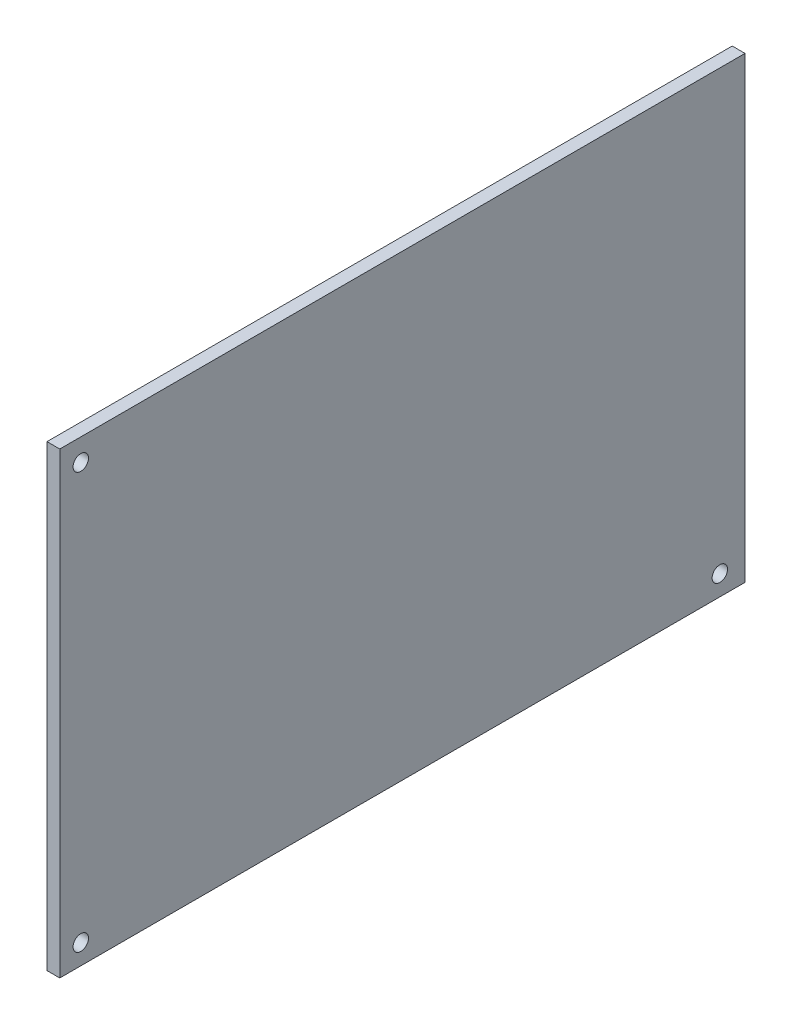
ISO-10303-21;
HEADER;
FILE_DESCRIPTION(('STEP AP214'),'2;1');
FILE_NAME('part.step','',(''),(''),'','','');
FILE_SCHEMA(('AUTOMOTIVE_DESIGN { 1 0 10303 214 1 1 1 1 }'));
ENDSEC;
DATA;
#1=APPLICATION_CONTEXT('core data for automotive mechanical design processes');
#2=APPLICATION_PROTOCOL_DEFINITION('international standard','automotive_design',2000,#1);
#3=PRODUCT_CONTEXT('',#1,'mechanical');
#4=PRODUCT('Part','Part','',(#3));
#5=PRODUCT_RELATED_PRODUCT_CATEGORY('part','',(#4));
#6=PRODUCT_DEFINITION_FORMATION('','',#4);
#7=PRODUCT_DEFINITION_CONTEXT('part definition',#1,'design');
#8=PRODUCT_DEFINITION('design','',#6,#7);
#9=PRODUCT_DEFINITION_SHAPE('','',#8);
#10=(LENGTH_UNIT() NAMED_UNIT(*) SI_UNIT(.MILLI.,.METRE.));
#11=(NAMED_UNIT(*) PLANE_ANGLE_UNIT() SI_UNIT($,.RADIAN.));
#12=(NAMED_UNIT(*) SI_UNIT($,.STERADIAN.) SOLID_ANGLE_UNIT());
#13=UNCERTAINTY_MEASURE_WITH_UNIT(LENGTH_MEASURE(1.E-05),#10,'distance_accuracy_value','');
#14=(GEOMETRIC_REPRESENTATION_CONTEXT(3) GLOBAL_UNCERTAINTY_ASSIGNED_CONTEXT((#13)) GLOBAL_UNIT_ASSIGNED_CONTEXT((#10,
#11,#12)) REPRESENTATION_CONTEXT('',''));
#15=CARTESIAN_POINT('',(0.,0.,0.));
#16=DIRECTION('',(0.,0.,1.));
#17=DIRECTION('',(1.,0.,0.));
#18=AXIS2_PLACEMENT_3D('',#15,#16,#17);
#19=CARTESIAN_POINT('',(1.66,0.,0.));
#20=DIRECTION('',(0.,0.,-1.));
#21=DIRECTION('',(0.,1.,0.));
#22=AXIS2_PLACEMENT_3D('',#19,#20,#21);
#23=PLANE('',#22);
#24=DIRECTION('',(0.,-1.,0.));
#25=VECTOR('',#24,1.);
#26=CARTESIAN_POINT('',(0.,0.,0.));
#27=LINE('',#26,#25);
#28=CARTESIAN_POINT('',(0.,59.5,0.));
#29=VERTEX_POINT('',#28);
#30=CARTESIAN_POINT('',(0.,0.,0.));
#31=VERTEX_POINT('',#30);
#32=EDGE_CURVE('E97',#29,#31,#27,.T.);
#33=ORIENTED_EDGE('',*,*,#32,.T.);
#34=DIRECTION('',(-1.,0.,0.));
#35=VECTOR('',#34,1.);
#36=CARTESIAN_POINT('',(1.66,0.,0.));
#37=LINE('',#36,#35);
#38=CARTESIAN_POINT('',(1.66,0.,0.));
#39=VERTEX_POINT('',#38);
#40=EDGE_CURVE('E11',#39,#31,#37,.T.);
#41=ORIENTED_EDGE('',*,*,#40,.F.);
#42=DIRECTION('',(0.,-1.,0.));
#43=VECTOR('',#42,1.);
#44=CARTESIAN_POINT('',(1.66,0.,0.));
#45=LINE('',#44,#43);
#46=CARTESIAN_POINT('',(1.66,59.5,0.));
#47=VERTEX_POINT('',#46);
#48=EDGE_CURVE('E85',#47,#39,#45,.T.);
#49=ORIENTED_EDGE('',*,*,#48,.F.);
#50=DIRECTION('',(-1.,0.,0.));
#51=VECTOR('',#50,1.);
#52=CARTESIAN_POINT('',(1.66,59.5,0.));
#53=LINE('',#52,#51);
#54=EDGE_CURVE('E93',#47,#29,#53,.T.);
#55=ORIENTED_EDGE('',*,*,#54,.T.);
#56=EDGE_LOOP('',(#33,#41,#49,#55));
#57=FACE_BOUND('',#56,.T.);
#58=ADVANCED_FACE('F34',(#57),#23,.F.);
#59=CARTESIAN_POINT('',(1.66,0.,0.));
#60=DIRECTION('',(0.,1.,0.));
#61=DIRECTION('',(0.,0.,1.));
#62=AXIS2_PLACEMENT_3D('',#59,#60,#61);
#63=PLANE('',#62);
#64=DIRECTION('',(0.,0.,-1.));
#65=VECTOR('',#64,1.);
#66=CARTESIAN_POINT('',(0.,0.,0.));
#67=LINE('',#66,#65);
#68=CARTESIAN_POINT('',(0.,0.,-89.));
#69=VERTEX_POINT('',#68);
#70=EDGE_CURVE('E89',#31,#69,#67,.T.);
#71=ORIENTED_EDGE('',*,*,#70,.T.);
#72=DIRECTION('',(-1.,0.,0.));
#73=VECTOR('',#72,1.);
#74=CARTESIAN_POINT('',(1.66,0.,-89.));
#75=LINE('',#74,#73);
#76=CARTESIAN_POINT('',(1.66,0.,-89.));
#77=VERTEX_POINT('',#76);
#78=EDGE_CURVE('E42',#77,#69,#75,.T.);
#79=ORIENTED_EDGE('',*,*,#78,.F.);
#80=DIRECTION('',(0.,0.,-1.));
#81=VECTOR('',#80,1.);
#82=CARTESIAN_POINT('',(1.66,0.,0.));
#83=LINE('',#82,#81);
#84=EDGE_CURVE('E80',#39,#77,#83,.T.);
#85=ORIENTED_EDGE('',*,*,#84,.F.);
#86=ORIENTED_EDGE('',*,*,#40,.T.);
#87=EDGE_LOOP('',(#71,#79,#85,#86));
#88=FACE_BOUND('',#87,.T.);
#89=ADVANCED_FACE('F88',(#88),#63,.F.);
#90=CARTESIAN_POINT('',(1.66,0.,-89.));
#91=DIRECTION('',(0.,0.,1.));
#92=DIRECTION('',(0.,-1.,0.));
#93=AXIS2_PLACEMENT_3D('',#90,#91,#92);
#94=PLANE('',#93);
#95=DIRECTION('',(0.,1.,0.));
#96=VECTOR('',#95,1.);
#97=CARTESIAN_POINT('',(0.,0.,-89.));
#98=LINE('',#97,#96);
#99=CARTESIAN_POINT('',(0.,59.5,-89.));
#100=VERTEX_POINT('',#99);
#101=EDGE_CURVE('E67',#69,#100,#98,.T.);
#102=ORIENTED_EDGE('',*,*,#101,.T.);
#103=DIRECTION('',(-1.,0.,0.));
#104=VECTOR('',#103,1.);
#105=CARTESIAN_POINT('',(1.66,59.5,-89.));
#106=LINE('',#105,#104);
#107=CARTESIAN_POINT('',(1.66,59.5,-89.));
#108=VERTEX_POINT('',#107);
#109=EDGE_CURVE('E90',#108,#100,#106,.T.);
#110=ORIENTED_EDGE('',*,*,#109,.F.);
#111=DIRECTION('',(0.,1.,0.));
#112=VECTOR('',#111,1.);
#113=CARTESIAN_POINT('',(1.66,0.,-89.));
#114=LINE('',#113,#112);
#115=EDGE_CURVE('E83',#77,#108,#114,.T.);
#116=ORIENTED_EDGE('',*,*,#115,.F.);
#117=ORIENTED_EDGE('',*,*,#78,.T.);
#118=EDGE_LOOP('',(#102,#110,#116,#117));
#119=FACE_BOUND('',#118,.T.);
#120=ADVANCED_FACE('F91',(#119),#94,.F.);
#121=CARTESIAN_POINT('',(1.66,59.5,0.));
#122=DIRECTION('',(0.,-1.,0.));
#123=DIRECTION('',(0.,0.,-1.));
#124=AXIS2_PLACEMENT_3D('',#121,#122,#123);
#125=PLANE('',#124);
#126=DIRECTION('',(0.,0.,1.));
#127=VECTOR('',#126,1.);
#128=CARTESIAN_POINT('',(0.,59.5,0.));
#129=LINE('',#128,#127);
#130=EDGE_CURVE('E73',#100,#29,#129,.T.);
#131=ORIENTED_EDGE('',*,*,#130,.T.);
#132=ORIENTED_EDGE('',*,*,#54,.F.);
#133=DIRECTION('',(0.,0.,1.));
#134=VECTOR('',#133,1.);
#135=CARTESIAN_POINT('',(1.66,59.5,0.));
#136=LINE('',#135,#134);
#137=EDGE_CURVE('E50',#108,#47,#136,.T.);
#138=ORIENTED_EDGE('',*,*,#137,.F.);
#139=ORIENTED_EDGE('',*,*,#109,.T.);
#140=EDGE_LOOP('',(#131,#132,#138,#139));
#141=FACE_BOUND('',#140,.T.);
#142=ADVANCED_FACE('F105',(#141),#125,.F.);
#143=CARTESIAN_POINT('',(1.66,59.5,0.));
#144=DIRECTION('',(-1.,0.,0.));
#145=DIRECTION('',(0.,0.,1.));
#146=AXIS2_PLACEMENT_3D('',#143,#144,#145);
#147=PLANE('',#146);
#148=CARTESIAN_POINT('',(1.66,56.6237237800636,-2.73193057527776));
#149=DIRECTION('',(-1.,0.,0.));
#150=DIRECTION('',(0.,0.,1.));
#151=AXIS2_PLACEMENT_3D('',#148,#149,#150);
#152=CIRCLE('',#151,1.);
#153=CARTESIAN_POINT('',(1.66,56.6237237800636,-1.73193057527776));
#154=VERTEX_POINT('',#153);
#155=EDGE_CURVE('E120',#154,#154,#152,.T.);
#156=ORIENTED_EDGE('',*,*,#155,.T.);
#157=EDGE_LOOP('',(#156));
#158=FACE_BOUND('',#157,.T.);
#159=CARTESIAN_POINT('',(1.66,2.62372378006363,-2.73193057527776));
#160=DIRECTION('',(-1.,0.,0.));
#161=DIRECTION('',(0.,0.,1.));
#162=AXIS2_PLACEMENT_3D('',#159,#160,#161);
#163=CIRCLE('',#162,1.);
#164=CARTESIAN_POINT('',(1.66,2.62372378006363,-1.73193057527776));
#165=VERTEX_POINT('',#164);
#166=EDGE_CURVE('E114',#165,#165,#163,.T.);
#167=ORIENTED_EDGE('',*,*,#166,.T.);
#168=EDGE_LOOP('',(#167));
#169=FACE_BOUND('',#168,.T.);
#170=CARTESIAN_POINT('',(1.66,2.62372378006362,-85.7319305752778));
#171=DIRECTION('',(-1.,0.,0.));
#172=DIRECTION('',(0.,0.,1.));
#173=AXIS2_PLACEMENT_3D('',#170,#171,#172);
#174=CIRCLE('',#173,0.999999999999998);
#175=CARTESIAN_POINT('',(1.66,2.62372378006362,-84.7319305752778));
#176=VERTEX_POINT('',#175);
#177=EDGE_CURVE('E100',#176,#176,#174,.T.);
#178=ORIENTED_EDGE('',*,*,#177,.T.);
#179=EDGE_LOOP('',(#178));
#180=FACE_BOUND('',#179,.T.);
#181=ORIENTED_EDGE('',*,*,#48,.T.);
#182=ORIENTED_EDGE('',*,*,#84,.T.);
#183=ORIENTED_EDGE('',*,*,#115,.T.);
#184=ORIENTED_EDGE('',*,*,#137,.T.);
#185=EDGE_LOOP('',(#181,#182,#183,#184));
#186=FACE_BOUND('',#185,.T.);
#187=ADVANCED_FACE('F81',(#158,#169,#180,#186),#147,.F.);
#188=CARTESIAN_POINT('',(0.,59.5,0.));
#189=DIRECTION('',(-1.,0.,0.));
#190=DIRECTION('',(0.,0.,1.));
#191=AXIS2_PLACEMENT_3D('',#188,#189,#190);
#192=PLANE('',#191);
#193=CARTESIAN_POINT('',(0.,56.6237237800636,-2.73193057527776));
#194=DIRECTION('',(-1.,0.,0.));
#195=DIRECTION('',(0.,0.,1.));
#196=AXIS2_PLACEMENT_3D('',#193,#194,#195);
#197=CIRCLE('',#196,1.);
#198=CARTESIAN_POINT('',(0.,56.6237237800636,-1.73193057527776));
#199=VERTEX_POINT('',#198);
#200=EDGE_CURVE('E123',#199,#199,#197,.T.);
#201=ORIENTED_EDGE('',*,*,#200,.F.);
#202=EDGE_LOOP('',(#201));
#203=FACE_BOUND('',#202,.T.);
#204=CARTESIAN_POINT('',(0.,2.62372378006363,-2.73193057527776));
#205=DIRECTION('',(-1.,0.,0.));
#206=DIRECTION('',(0.,0.,1.));
#207=AXIS2_PLACEMENT_3D('',#204,#205,#206);
#208=CIRCLE('',#207,1.);
#209=CARTESIAN_POINT('',(0.,2.62372378006363,-1.73193057527776));
#210=VERTEX_POINT('',#209);
#211=EDGE_CURVE('E117',#210,#210,#208,.T.);
#212=ORIENTED_EDGE('',*,*,#211,.F.);
#213=EDGE_LOOP('',(#212));
#214=FACE_BOUND('',#213,.T.);
#215=CARTESIAN_POINT('',(0.,2.62372378006362,-85.7319305752778));
#216=DIRECTION('',(-1.,0.,0.));
#217=DIRECTION('',(0.,0.,1.));
#218=AXIS2_PLACEMENT_3D('',#215,#216,#217);
#219=CIRCLE('',#218,0.999999999999998);
#220=CARTESIAN_POINT('',(0.,2.62372378006362,-84.7319305752778));
#221=VERTEX_POINT('',#220);
#222=EDGE_CURVE('E111',#221,#221,#219,.T.);
#223=ORIENTED_EDGE('',*,*,#222,.F.);
#224=EDGE_LOOP('',(#223));
#225=FACE_BOUND('',#224,.T.);
#226=ORIENTED_EDGE('',*,*,#32,.F.);
#227=ORIENTED_EDGE('',*,*,#130,.F.);
#228=ORIENTED_EDGE('',*,*,#101,.F.);
#229=ORIENTED_EDGE('',*,*,#70,.F.);
#230=EDGE_LOOP('',(#226,#227,#228,#229));
#231=FACE_BOUND('',#230,.T.);
#232=ADVANCED_FACE('F108',(#203,#214,#225,#231),#192,.T.);
#233=CARTESIAN_POINT('',(1.66,2.62372378006362,-85.7319305752778));
#234=DIRECTION('',(-1.,0.,0.));
#235=DIRECTION('',(0.,0.,1.));
#236=AXIS2_PLACEMENT_3D('',#233,#234,#235);
#237=CYLINDRICAL_SURFACE('',#236,0.999999999999998);
#238=ORIENTED_EDGE('',*,*,#177,.F.);
#239=EDGE_LOOP('',(#238));
#240=FACE_BOUND('',#239,.T.);
#241=ORIENTED_EDGE('',*,*,#222,.T.);
#242=EDGE_LOOP('',(#241));
#243=FACE_BOUND('',#242,.T.);
#244=ADVANCED_FACE('F140',(#240,#243),#237,.F.);
#245=CARTESIAN_POINT('',(1.66,2.62372378006363,-2.73193057527776));
#246=DIRECTION('',(-1.,0.,0.));
#247=DIRECTION('',(0.,0.,1.));
#248=AXIS2_PLACEMENT_3D('',#245,#246,#247);
#249=CYLINDRICAL_SURFACE('',#248,1.);
#250=ORIENTED_EDGE('',*,*,#166,.F.);
#251=EDGE_LOOP('',(#250));
#252=FACE_BOUND('',#251,.T.);
#253=ORIENTED_EDGE('',*,*,#211,.T.);
#254=EDGE_LOOP('',(#253));
#255=FACE_BOUND('',#254,.T.);
#256=ADVANCED_FACE('F134',(#252,#255),#249,.F.);
#257=CARTESIAN_POINT('',(1.66,56.6237237800636,-2.73193057527776));
#258=DIRECTION('',(-1.,0.,0.));
#259=DIRECTION('',(0.,0.,1.));
#260=AXIS2_PLACEMENT_3D('',#257,#258,#259);
#261=CYLINDRICAL_SURFACE('',#260,1.);
#262=ORIENTED_EDGE('',*,*,#155,.F.);
#263=EDGE_LOOP('',(#262));
#264=FACE_BOUND('',#263,.T.);
#265=ORIENTED_EDGE('',*,*,#200,.T.);
#266=EDGE_LOOP('',(#265));
#267=FACE_BOUND('',#266,.T.);
#268=ADVANCED_FACE('F131',(#264,#267),#261,.F.);
#269=CLOSED_SHELL('',(#58,#89,#120,#142,#187,#232,#244,#256,#268));
#270=MANIFOLD_SOLID_BREP('B2',#269);
#271=ADVANCED_BREP_SHAPE_REPRESENTATION('',(#18,#270),#14);
#272=SHAPE_DEFINITION_REPRESENTATION(#9,#271);
ENDSEC;
END-ISO-10303-21;
